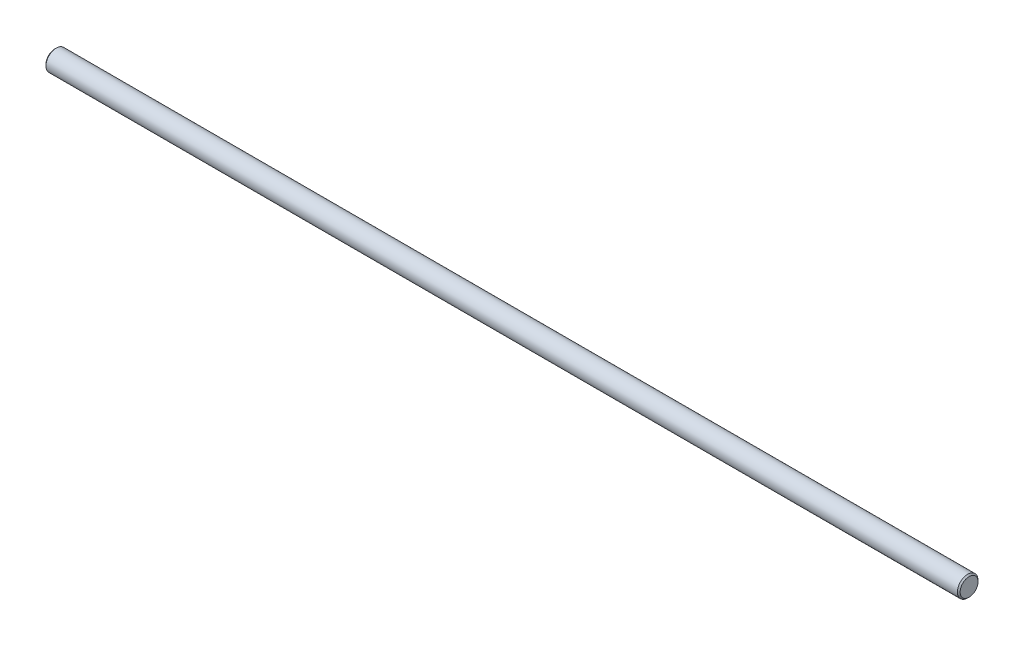
ISO-10303-21;
HEADER;
FILE_DESCRIPTION(('STEP AP214'),'2;1');
FILE_NAME('part.step','',(''),(''),'','','');
FILE_SCHEMA(('AUTOMOTIVE_DESIGN { 1 0 10303 214 1 1 1 1 }'));
ENDSEC;
DATA;
#1=APPLICATION_CONTEXT('core data for automotive mechanical design processes');
#2=APPLICATION_PROTOCOL_DEFINITION('international standard','automotive_design',2000,#1);
#3=PRODUCT_CONTEXT('',#1,'mechanical');
#4=PRODUCT('Part','Part','',(#3));
#5=PRODUCT_RELATED_PRODUCT_CATEGORY('part','',(#4));
#6=PRODUCT_DEFINITION_FORMATION('','',#4);
#7=PRODUCT_DEFINITION_CONTEXT('part definition',#1,'design');
#8=PRODUCT_DEFINITION('design','',#6,#7);
#9=PRODUCT_DEFINITION_SHAPE('','',#8);
#10=(LENGTH_UNIT() NAMED_UNIT(*) SI_UNIT(.MILLI.,.METRE.));
#11=(NAMED_UNIT(*) PLANE_ANGLE_UNIT() SI_UNIT($,.RADIAN.));
#12=(NAMED_UNIT(*) SI_UNIT($,.STERADIAN.) SOLID_ANGLE_UNIT());
#13=UNCERTAINTY_MEASURE_WITH_UNIT(LENGTH_MEASURE(1.E-05),#10,'distance_accuracy_value','');
#14=(GEOMETRIC_REPRESENTATION_CONTEXT(3) GLOBAL_UNCERTAINTY_ASSIGNED_CONTEXT((#13)) GLOBAL_UNIT_ASSIGNED_CONTEXT((#10,
#11,#12)) REPRESENTATION_CONTEXT('',''));
#15=CARTESIAN_POINT('',(0.,0.,0.));
#16=DIRECTION('',(0.,0.,1.));
#17=DIRECTION('',(1.,0.,0.));
#18=AXIS2_PLACEMENT_3D('',#15,#16,#17);
#19=CARTESIAN_POINT('',(133.,0.,0.));
#20=DIRECTION('',(-1.,0.,0.));
#21=DIRECTION('',(0.,0.,1.));
#22=AXIS2_PLACEMENT_3D('',#19,#20,#21);
#23=CYLINDRICAL_SURFACE('',#22,1.5);
#24=CARTESIAN_POINT('',(0.199999999999978,0.,0.));
#25=DIRECTION('',(1.,0.,0.));
#26=DIRECTION('',(0.,0.,-1.));
#27=AXIS2_PLACEMENT_3D('',#24,#25,#26);
#28=CIRCLE('',#27,1.5);
#29=CARTESIAN_POINT('',(0.199999999999978,0.,-1.5));
#30=VERTEX_POINT('',#29);
#31=EDGE_CURVE('E41',#30,#30,#28,.T.);
#32=ORIENTED_EDGE('',*,*,#31,.T.);
#33=EDGE_LOOP('',(#32));
#34=FACE_BOUND('',#33,.T.);
#35=CARTESIAN_POINT('',(132.8,0.,0.));
#36=DIRECTION('',(1.,0.,0.));
#37=DIRECTION('',(0.,0.,-1.));
#38=AXIS2_PLACEMENT_3D('',#35,#36,#37);
#39=CIRCLE('',#38,1.5);
#40=CARTESIAN_POINT('',(132.8,0.,-1.5));
#41=VERTEX_POINT('',#40);
#42=EDGE_CURVE('E45',#41,#41,#39,.F.);
#43=ORIENTED_EDGE('',*,*,#42,.T.);
#44=EDGE_LOOP('',(#43));
#45=FACE_BOUND('',#44,.T.);
#46=ADVANCED_FACE('F30',(#34,#45),#23,.T.);
#47=CARTESIAN_POINT('',(133.,0.,0.));
#48=DIRECTION('',(1.,0.,0.));
#49=DIRECTION('',(0.,0.,-1.));
#50=AXIS2_PLACEMENT_3D('',#47,#48,#49);
#51=PLANE('',#50);
#52=CARTESIAN_POINT('',(133.,0.,0.));
#53=DIRECTION('',(1.,0.,0.));
#54=DIRECTION('',(0.,0.,-1.));
#55=AXIS2_PLACEMENT_3D('',#52,#53,#54);
#56=CIRCLE('',#55,1.3);
#57=CARTESIAN_POINT('',(133.,0.,-1.3));
#58=VERTEX_POINT('',#57);
#59=EDGE_CURVE('E10',#58,#58,#56,.T.);
#60=ORIENTED_EDGE('',*,*,#59,.T.);
#61=EDGE_LOOP('',(#60));
#62=FACE_BOUND('',#61,.T.);
#63=ADVANCED_FACE('F61',(#62),#51,.T.);
#64=CARTESIAN_POINT('',(0.,0.,0.));
#65=DIRECTION('',(1.,0.,0.));
#66=DIRECTION('',(0.,0.,-1.));
#67=AXIS2_PLACEMENT_3D('',#64,#65,#66);
#68=PLANE('',#67);
#69=CARTESIAN_POINT('',(0.,0.,0.));
#70=DIRECTION('',(1.,0.,0.));
#71=DIRECTION('',(0.,0.,-1.));
#72=AXIS2_PLACEMENT_3D('',#69,#70,#71);
#73=CIRCLE('',#72,1.30000000000002);
#74=CARTESIAN_POINT('',(0.,0.,-1.30000000000002));
#75=VERTEX_POINT('',#74);
#76=EDGE_CURVE('E37',#75,#75,#73,.F.);
#77=ORIENTED_EDGE('',*,*,#76,.T.);
#78=EDGE_LOOP('',(#77));
#79=FACE_BOUND('',#78,.T.);
#80=ADVANCED_FACE('F58',(#79),#68,.F.);
#81=CARTESIAN_POINT('',(0.199999999999978,0.,0.));
#82=DIRECTION('',(1.,0.,0.));
#83=DIRECTION('',(0.,0.,-1.));
#84=AXIS2_PLACEMENT_3D('',#81,#82,#83);
#85=CONICAL_SURFACE('',#84,1.5,0.785398163397445);
#86=ORIENTED_EDGE('',*,*,#76,.F.);
#87=EDGE_LOOP('',(#86));
#88=FACE_BOUND('',#87,.T.);
#89=ORIENTED_EDGE('',*,*,#31,.F.);
#90=EDGE_LOOP('',(#89));
#91=FACE_BOUND('',#90,.T.);
#92=ADVANCED_FACE('F54',(#88,#91),#85,.T.);
#93=CARTESIAN_POINT('',(133.,0.,0.));
#94=DIRECTION('',(-1.,0.,0.));
#95=DIRECTION('',(0.,0.,1.));
#96=AXIS2_PLACEMENT_3D('',#93,#94,#95);
#97=CONICAL_SURFACE('',#96,1.3,0.785398163397446);
#98=ORIENTED_EDGE('',*,*,#42,.F.);
#99=EDGE_LOOP('',(#98));
#100=FACE_BOUND('',#99,.T.);
#101=ORIENTED_EDGE('',*,*,#59,.F.);
#102=EDGE_LOOP('',(#101));
#103=FACE_BOUND('',#102,.T.);
#104=ADVANCED_FACE('F32',(#100,#103),#97,.T.);
#105=CLOSED_SHELL('',(#46,#63,#80,#92,#104));
#106=MANIFOLD_SOLID_BREP('B2',#105);
#107=ADVANCED_BREP_SHAPE_REPRESENTATION('',(#18,#106),#14);
#108=SHAPE_DEFINITION_REPRESENTATION(#9,#107);
ENDSEC;
END-ISO-10303-21;
